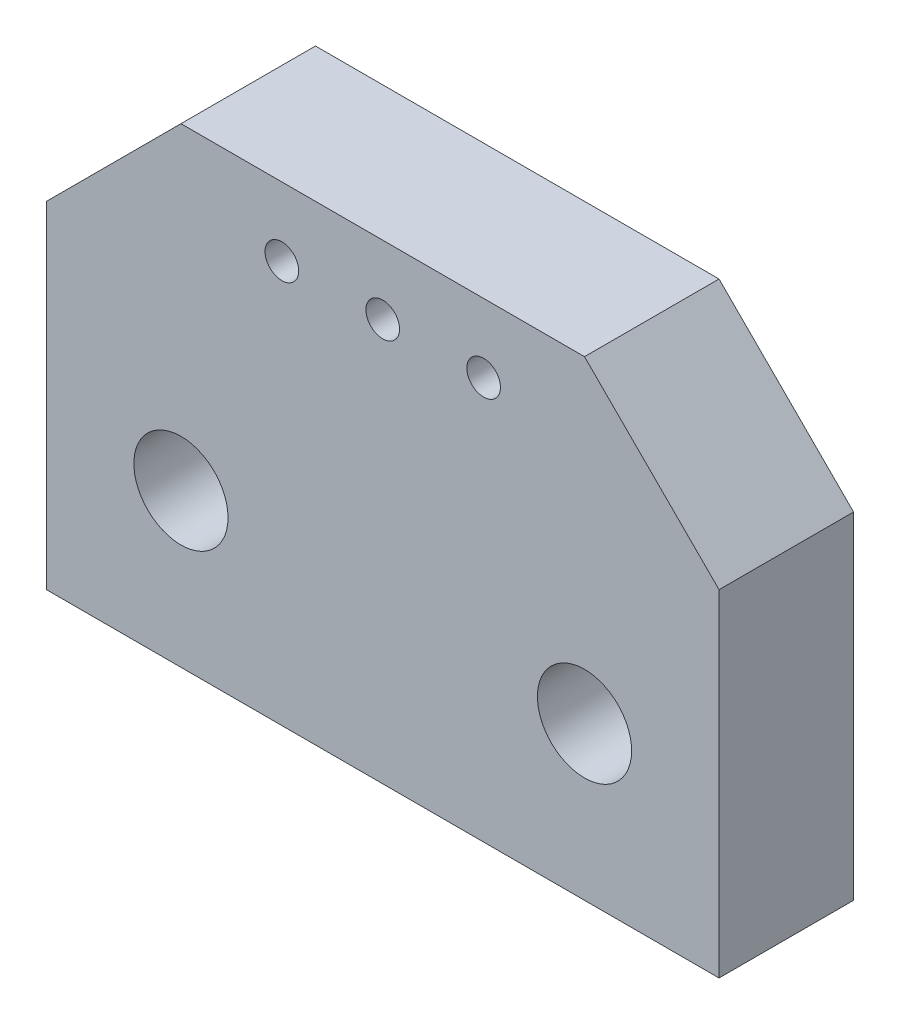
ISO-10303-21;
HEADER;
FILE_DESCRIPTION(('STEP AP214'),'2;1');
FILE_NAME('part.step','',(''),(''),'','','');
FILE_SCHEMA(('AUTOMOTIVE_DESIGN { 1 0 10303 214 1 1 1 1 }'));
ENDSEC;
DATA;
#1=APPLICATION_CONTEXT('core data for automotive mechanical design processes');
#2=APPLICATION_PROTOCOL_DEFINITION('international standard','automotive_design',2000,#1);
#3=PRODUCT_CONTEXT('',#1,'mechanical');
#4=PRODUCT('Part','Part','',(#3));
#5=PRODUCT_RELATED_PRODUCT_CATEGORY('part','',(#4));
#6=PRODUCT_DEFINITION_FORMATION('','',#4);
#7=PRODUCT_DEFINITION_CONTEXT('part definition',#1,'design');
#8=PRODUCT_DEFINITION('design','',#6,#7);
#9=PRODUCT_DEFINITION_SHAPE('','',#8);
#10=(LENGTH_UNIT() NAMED_UNIT(*) SI_UNIT(.MILLI.,.METRE.));
#11=(NAMED_UNIT(*) PLANE_ANGLE_UNIT() SI_UNIT($,.RADIAN.));
#12=(NAMED_UNIT(*) SI_UNIT($,.STERADIAN.) SOLID_ANGLE_UNIT());
#13=UNCERTAINTY_MEASURE_WITH_UNIT(LENGTH_MEASURE(1.E-05),#10,'distance_accuracy_value','');
#14=(GEOMETRIC_REPRESENTATION_CONTEXT(3) GLOBAL_UNCERTAINTY_ASSIGNED_CONTEXT((#13)) GLOBAL_UNIT_ASSIGNED_CONTEXT((#10,
#11,#12)) REPRESENTATION_CONTEXT('',''));
#15=CARTESIAN_POINT('',(0.,0.,0.));
#16=DIRECTION('',(0.,0.,1.));
#17=DIRECTION('',(1.,0.,0.));
#18=AXIS2_PLACEMENT_3D('',#15,#16,#17);
#19=CARTESIAN_POINT('',(0.,0.,2.));
#20=DIRECTION('',(0.,0.,-1.));
#21=DIRECTION('',(-1.,0.,0.));
#22=AXIS2_PLACEMENT_3D('',#19,#20,#21);
#23=PLANE('',#22);
#24=CARTESIAN_POINT('',(6.09710991907803,5.97930011210051,2.));
#25=DIRECTION('',(0.,0.,1.));
#26=DIRECTION('',(1.,0.,0.));
#27=AXIS2_PLACEMENT_3D('',#24,#25,#26);
#28=CIRCLE('',#27,0.249999999999999);
#29=CARTESIAN_POINT('',(6.34710991907803,5.97930011210051,2.));
#30=VERTEX_POINT('',#29);
#31=EDGE_CURVE('E189',#30,#30,#28,.T.);
#32=ORIENTED_EDGE('',*,*,#31,.F.);
#33=EDGE_LOOP('',(#32));
#34=FACE_BOUND('',#33,.T.);
#35=CARTESIAN_POINT('',(4.59710991907803,5.97930011210051,2.));
#36=DIRECTION('',(0.,0.,1.));
#37=DIRECTION('',(1.,0.,0.));
#38=AXIS2_PLACEMENT_3D('',#35,#36,#37);
#39=CIRCLE('',#38,0.249999999999999);
#40=CARTESIAN_POINT('',(4.84710991907803,5.97930011210051,2.));
#41=VERTEX_POINT('',#40);
#42=EDGE_CURVE('E191',#41,#41,#39,.T.);
#43=ORIENTED_EDGE('',*,*,#42,.F.);
#44=EDGE_LOOP('',(#43));
#45=FACE_BOUND('',#44,.T.);
#46=DIRECTION('',(1.,0.,0.));
#47=VECTOR('',#46,1.);
#48=CARTESIAN_POINT('',(11.097109919078,0.,2.));
#49=LINE('',#48,#47);
#50=CARTESIAN_POINT('',(1.09710991907802,0.,2.));
#51=VERTEX_POINT('',#50);
#52=CARTESIAN_POINT('',(11.097109919078,0.,2.));
#53=VERTEX_POINT('',#52);
#54=EDGE_CURVE('E130',#51,#53,#49,.T.);
#55=ORIENTED_EDGE('',*,*,#54,.T.);
#56=DIRECTION('',(0.,1.,0.));
#57=VECTOR('',#56,1.);
#58=CARTESIAN_POINT('',(11.097109919078,5.,2.));
#59=LINE('',#58,#57);
#60=CARTESIAN_POINT('',(11.097109919078,5.,2.));
#61=VERTEX_POINT('',#60);
#62=EDGE_CURVE('E88',#53,#61,#59,.T.);
#63=ORIENTED_EDGE('',*,*,#62,.T.);
#64=DIRECTION('',(-0.707106781186547,0.707106781186547,0.));
#65=VECTOR('',#64,1.);
#66=CARTESIAN_POINT('',(9.09710991907796,7.00000000000008,2.));
#67=LINE('',#66,#65);
#68=CARTESIAN_POINT('',(9.09710991907796,7.00000000000008,2.));
#69=VERTEX_POINT('',#68);
#70=EDGE_CURVE('E101',#61,#69,#67,.T.);
#71=ORIENTED_EDGE('',*,*,#70,.T.);
#72=DIRECTION('',(-1.,0.,0.));
#73=VECTOR('',#72,1.);
#74=CARTESIAN_POINT('',(3.09710991907811,7.00000000000008,2.));
#75=LINE('',#74,#73);
#76=CARTESIAN_POINT('',(3.09710991907811,7.00000000000008,2.));
#77=VERTEX_POINT('',#76);
#78=EDGE_CURVE('E95',#69,#77,#75,.T.);
#79=ORIENTED_EDGE('',*,*,#78,.T.);
#80=DIRECTION('',(-0.707106781186547,-0.707106781186547,0.));
#81=VECTOR('',#80,1.);
#82=CARTESIAN_POINT('',(1.09710991907803,5.,2.));
#83=LINE('',#82,#81);
#84=CARTESIAN_POINT('',(1.09710991907803,5.,2.));
#85=VERTEX_POINT('',#84);
#86=EDGE_CURVE('E99',#77,#85,#83,.T.);
#87=ORIENTED_EDGE('',*,*,#86,.T.);
#88=DIRECTION('',(0.,-1.,0.));
#89=VECTOR('',#88,1.);
#90=CARTESIAN_POINT('',(1.09710991907802,0.,2.));
#91=LINE('',#90,#89);
#92=EDGE_CURVE('E51',#85,#51,#91,.T.);
#93=ORIENTED_EDGE('',*,*,#92,.T.);
#94=EDGE_LOOP('',(#55,#63,#71,#79,#87,#93));
#95=FACE_BOUND('',#94,.T.);
#96=CARTESIAN_POINT('',(9.09710991907803,2.27502281048797,2.));
#97=DIRECTION('',(0.,0.,1.));
#98=DIRECTION('',(1.,0.,0.));
#99=AXIS2_PLACEMENT_3D('',#96,#97,#98);
#100=CIRCLE('',#99,0.699999999999989);
#101=CARTESIAN_POINT('',(9.79710991907802,2.27502281048797,2.));
#102=VERTEX_POINT('',#101);
#103=EDGE_CURVE('E210',#102,#102,#100,.T.);
#104=ORIENTED_EDGE('',*,*,#103,.F.);
#105=EDGE_LOOP('',(#104));
#106=FACE_BOUND('',#105,.T.);
#107=CARTESIAN_POINT('',(3.09710991907803,2.27502281048797,2.));
#108=DIRECTION('',(0.,0.,1.));
#109=DIRECTION('',(1.,0.,0.));
#110=AXIS2_PLACEMENT_3D('',#107,#108,#109);
#111=CIRCLE('',#110,0.699999999999989);
#112=CARTESIAN_POINT('',(3.79710991907802,2.27502281048797,2.));
#113=VERTEX_POINT('',#112);
#114=EDGE_CURVE('E204',#113,#113,#111,.T.);
#115=ORIENTED_EDGE('',*,*,#114,.F.);
#116=EDGE_LOOP('',(#115));
#117=FACE_BOUND('',#116,.T.);
#118=CARTESIAN_POINT('',(7.59710991907803,5.97930011210051,2.));
#119=DIRECTION('',(0.,0.,1.));
#120=DIRECTION('',(1.,0.,0.));
#121=AXIS2_PLACEMENT_3D('',#118,#119,#120);
#122=CIRCLE('',#121,0.249999999999999);
#123=CARTESIAN_POINT('',(7.84710991907803,5.97930011210051,2.));
#124=VERTEX_POINT('',#123);
#125=EDGE_CURVE('E198',#124,#124,#122,.T.);
#126=ORIENTED_EDGE('',*,*,#125,.F.);
#127=EDGE_LOOP('',(#126));
#128=FACE_BOUND('',#127,.T.);
#129=ADVANCED_FACE('F33',(#34,#45,#95,#106,#117,#128),#23,.F.);
#130=CARTESIAN_POINT('',(11.097109919078,0.,2.));
#131=DIRECTION('',(0.,1.,0.));
#132=DIRECTION('',(-1.,0.,0.));
#133=AXIS2_PLACEMENT_3D('',#130,#131,#132);
#134=PLANE('',#133);
#135=DIRECTION('',(1.,0.,0.));
#136=VECTOR('',#135,1.);
#137=CARTESIAN_POINT('',(11.097109919078,0.,0.));
#138=LINE('',#137,#136);
#139=CARTESIAN_POINT('',(1.09710991907802,0.,0.));
#140=VERTEX_POINT('',#139);
#141=CARTESIAN_POINT('',(11.097109919078,0.,0.));
#142=VERTEX_POINT('',#141);
#143=EDGE_CURVE('E119',#140,#142,#138,.T.);
#144=ORIENTED_EDGE('',*,*,#143,.T.);
#145=DIRECTION('',(0.,0.,-1.));
#146=VECTOR('',#145,1.);
#147=CARTESIAN_POINT('',(11.097109919078,0.,2.));
#148=LINE('',#147,#146);
#149=EDGE_CURVE('E11',#53,#142,#148,.T.);
#150=ORIENTED_EDGE('',*,*,#149,.F.);
#151=ORIENTED_EDGE('',*,*,#54,.F.);
#152=DIRECTION('',(0.,0.,-1.));
#153=VECTOR('',#152,1.);
#154=CARTESIAN_POINT('',(1.09710991907802,0.,2.));
#155=LINE('',#154,#153);
#156=EDGE_CURVE('E115',#51,#140,#155,.T.);
#157=ORIENTED_EDGE('',*,*,#156,.T.);
#158=EDGE_LOOP('',(#144,#150,#151,#157));
#159=FACE_BOUND('',#158,.T.);
#160=ADVANCED_FACE('F35',(#159),#134,.F.);
#161=CARTESIAN_POINT('',(11.097109919078,5.,2.));
#162=DIRECTION('',(-1.,0.,0.));
#163=DIRECTION('',(0.,-1.,0.));
#164=AXIS2_PLACEMENT_3D('',#161,#162,#163);
#165=PLANE('',#164);
#166=DIRECTION('',(0.,1.,0.));
#167=VECTOR('',#166,1.);
#168=CARTESIAN_POINT('',(11.097109919078,5.,0.));
#169=LINE('',#168,#167);
#170=CARTESIAN_POINT('',(11.097109919078,5.,0.));
#171=VERTEX_POINT('',#170);
#172=EDGE_CURVE('E122',#142,#171,#169,.T.);
#173=ORIENTED_EDGE('',*,*,#172,.T.);
#174=DIRECTION('',(0.,0.,-1.));
#175=VECTOR('',#174,1.);
#176=CARTESIAN_POINT('',(11.097109919078,5.,2.));
#177=LINE('',#176,#175);
#178=EDGE_CURVE('E43',#61,#171,#177,.T.);
#179=ORIENTED_EDGE('',*,*,#178,.F.);
#180=ORIENTED_EDGE('',*,*,#62,.F.);
#181=ORIENTED_EDGE('',*,*,#149,.T.);
#182=EDGE_LOOP('',(#173,#179,#180,#181));
#183=FACE_BOUND('',#182,.T.);
#184=ADVANCED_FACE('F161',(#183),#165,.F.);
#185=CARTESIAN_POINT('',(9.09710991907796,7.00000000000008,2.));
#186=DIRECTION('',(-0.707106781186547,-0.707106781186547,0.));
#187=DIRECTION('',(0.707106781186548,-0.707106781186548,0.));
#188=AXIS2_PLACEMENT_3D('',#185,#186,#187);
#189=PLANE('',#188);
#190=DIRECTION('',(-0.707106781186547,0.707106781186547,0.));
#191=VECTOR('',#190,1.);
#192=CARTESIAN_POINT('',(9.09710991907796,7.00000000000008,0.));
#193=LINE('',#192,#191);
#194=CARTESIAN_POINT('',(9.09710991907796,7.00000000000008,0.));
#195=VERTEX_POINT('',#194);
#196=EDGE_CURVE('E125',#171,#195,#193,.T.);
#197=ORIENTED_EDGE('',*,*,#196,.T.);
#198=DIRECTION('',(0.,0.,-1.));
#199=VECTOR('',#198,1.);
#200=CARTESIAN_POINT('',(9.09710991907796,7.00000000000008,2.));
#201=LINE('',#200,#199);
#202=EDGE_CURVE('E110',#69,#195,#201,.T.);
#203=ORIENTED_EDGE('',*,*,#202,.F.);
#204=ORIENTED_EDGE('',*,*,#70,.F.);
#205=ORIENTED_EDGE('',*,*,#178,.T.);
#206=EDGE_LOOP('',(#197,#203,#204,#205));
#207=FACE_BOUND('',#206,.T.);
#208=ADVANCED_FACE('F137',(#207),#189,.F.);
#209=CARTESIAN_POINT('',(3.09710991907811,7.00000000000008,2.));
#210=DIRECTION('',(0.,-1.,0.));
#211=DIRECTION('',(0.,0.,-1.));
#212=AXIS2_PLACEMENT_3D('',#209,#210,#211);
#213=PLANE('',#212);
#214=DIRECTION('',(-1.,0.,0.));
#215=VECTOR('',#214,1.);
#216=CARTESIAN_POINT('',(3.09710991907811,7.00000000000008,0.));
#217=LINE('',#216,#215);
#218=CARTESIAN_POINT('',(3.09710991907811,7.00000000000008,0.));
#219=VERTEX_POINT('',#218);
#220=EDGE_CURVE('E109',#195,#219,#217,.T.);
#221=ORIENTED_EDGE('',*,*,#220,.T.);
#222=DIRECTION('',(0.,0.,-1.));
#223=VECTOR('',#222,1.);
#224=CARTESIAN_POINT('',(3.09710991907811,7.00000000000008,2.));
#225=LINE('',#224,#223);
#226=EDGE_CURVE('E106',#77,#219,#225,.T.);
#227=ORIENTED_EDGE('',*,*,#226,.F.);
#228=ORIENTED_EDGE('',*,*,#78,.F.);
#229=ORIENTED_EDGE('',*,*,#202,.T.);
#230=EDGE_LOOP('',(#221,#227,#228,#229));
#231=FACE_BOUND('',#230,.T.);
#232=ADVANCED_FACE('F107',(#231),#213,.F.);
#233=CARTESIAN_POINT('',(1.09710991907803,5.,2.));
#234=DIRECTION('',(0.707106781186547,-0.707106781186547,0.));
#235=DIRECTION('',(0.707106781186548,0.707106781186548,0.));
#236=AXIS2_PLACEMENT_3D('',#233,#234,#235);
#237=PLANE('',#236);
#238=DIRECTION('',(-0.707106781186547,-0.707106781186547,0.));
#239=VECTOR('',#238,1.);
#240=CARTESIAN_POINT('',(1.09710991907803,5.,0.));
#241=LINE('',#240,#239);
#242=CARTESIAN_POINT('',(1.09710991907803,5.,0.));
#243=VERTEX_POINT('',#242);
#244=EDGE_CURVE('E74',#219,#243,#241,.T.);
#245=ORIENTED_EDGE('',*,*,#244,.T.);
#246=DIRECTION('',(0.,0.,-1.));
#247=VECTOR('',#246,1.);
#248=CARTESIAN_POINT('',(1.09710991907803,5.,2.));
#249=LINE('',#248,#247);
#250=EDGE_CURVE('E111',#85,#243,#249,.T.);
#251=ORIENTED_EDGE('',*,*,#250,.F.);
#252=ORIENTED_EDGE('',*,*,#86,.F.);
#253=ORIENTED_EDGE('',*,*,#226,.T.);
#254=EDGE_LOOP('',(#245,#251,#252,#253));
#255=FACE_BOUND('',#254,.T.);
#256=ADVANCED_FACE('F113',(#255),#237,.F.);
#257=CARTESIAN_POINT('',(1.09710991907802,0.,2.));
#258=DIRECTION('',(1.,0.,0.));
#259=DIRECTION('',(0.,1.,0.));
#260=AXIS2_PLACEMENT_3D('',#257,#258,#259);
#261=PLANE('',#260);
#262=DIRECTION('',(0.,-1.,0.));
#263=VECTOR('',#262,1.);
#264=CARTESIAN_POINT('',(1.09710991907802,0.,0.));
#265=LINE('',#264,#263);
#266=EDGE_CURVE('E80',#243,#140,#265,.T.);
#267=ORIENTED_EDGE('',*,*,#266,.T.);
#268=ORIENTED_EDGE('',*,*,#156,.F.);
#269=ORIENTED_EDGE('',*,*,#92,.F.);
#270=ORIENTED_EDGE('',*,*,#250,.T.);
#271=EDGE_LOOP('',(#267,#268,#269,#270));
#272=FACE_BOUND('',#271,.T.);
#273=ADVANCED_FACE('F144',(#272),#261,.F.);
#274=CARTESIAN_POINT('',(0.,0.,0.));
#275=DIRECTION('',(0.,0.,-1.));
#276=DIRECTION('',(-1.,0.,0.));
#277=AXIS2_PLACEMENT_3D('',#274,#275,#276);
#278=PLANE('',#277);
#279=CARTESIAN_POINT('',(6.09710991907803,5.97930011210051,0.));
#280=DIRECTION('',(0.,0.,-1.));
#281=DIRECTION('',(-1.,0.,0.));
#282=AXIS2_PLACEMENT_3D('',#279,#280,#281);
#283=CIRCLE('',#282,0.249999999999998);
#284=CARTESIAN_POINT('',(5.84710991907804,5.97930011210051,0.));
#285=VERTEX_POINT('',#284);
#286=EDGE_CURVE('E37',#285,#285,#283,.T.);
#287=ORIENTED_EDGE('',*,*,#286,.F.);
#288=EDGE_LOOP('',(#287));
#289=FACE_BOUND('',#288,.T.);
#290=CARTESIAN_POINT('',(4.59710991907803,5.97930011210051,0.));
#291=DIRECTION('',(0.,0.,-1.));
#292=DIRECTION('',(-1.,0.,0.));
#293=AXIS2_PLACEMENT_3D('',#290,#291,#292);
#294=CIRCLE('',#293,0.249999999999998);
#295=CARTESIAN_POINT('',(4.34710991907803,5.97930011210051,0.));
#296=VERTEX_POINT('',#295);
#297=EDGE_CURVE('E195',#296,#296,#294,.T.);
#298=ORIENTED_EDGE('',*,*,#297,.F.);
#299=EDGE_LOOP('',(#298));
#300=FACE_BOUND('',#299,.T.);
#301=CARTESIAN_POINT('',(7.59710991907803,5.97930011210051,0.));
#302=DIRECTION('',(0.,0.,-1.));
#303=DIRECTION('',(-1.,0.,0.));
#304=AXIS2_PLACEMENT_3D('',#301,#302,#303);
#305=CIRCLE('',#304,0.249999999999998);
#306=CARTESIAN_POINT('',(7.34710991907804,5.97930011210051,0.));
#307=VERTEX_POINT('',#306);
#308=EDGE_CURVE('E201',#307,#307,#305,.T.);
#309=ORIENTED_EDGE('',*,*,#308,.F.);
#310=EDGE_LOOP('',(#309));
#311=FACE_BOUND('',#310,.T.);
#312=CARTESIAN_POINT('',(3.09710991907803,2.27502281048797,0.));
#313=DIRECTION('',(0.,0.,-1.));
#314=DIRECTION('',(-1.,0.,0.));
#315=AXIS2_PLACEMENT_3D('',#312,#313,#314);
#316=CIRCLE('',#315,0.699999999999988);
#317=CARTESIAN_POINT('',(2.39710991907805,2.27502281048797,0.));
#318=VERTEX_POINT('',#317);
#319=EDGE_CURVE('E207',#318,#318,#316,.T.);
#320=ORIENTED_EDGE('',*,*,#319,.F.);
#321=EDGE_LOOP('',(#320));
#322=FACE_BOUND('',#321,.T.);
#323=CARTESIAN_POINT('',(9.09710991907803,2.27502281048797,0.));
#324=DIRECTION('',(0.,0.,-1.));
#325=DIRECTION('',(-1.,0.,0.));
#326=AXIS2_PLACEMENT_3D('',#323,#324,#325);
#327=CIRCLE('',#326,0.699999999999988);
#328=CARTESIAN_POINT('',(8.39710991907805,2.27502281048797,0.));
#329=VERTEX_POINT('',#328);
#330=EDGE_CURVE('E123',#329,#329,#327,.T.);
#331=ORIENTED_EDGE('',*,*,#330,.F.);
#332=EDGE_LOOP('',(#331));
#333=FACE_BOUND('',#332,.T.);
#334=ORIENTED_EDGE('',*,*,#143,.F.);
#335=ORIENTED_EDGE('',*,*,#266,.F.);
#336=ORIENTED_EDGE('',*,*,#244,.F.);
#337=ORIENTED_EDGE('',*,*,#220,.F.);
#338=ORIENTED_EDGE('',*,*,#196,.F.);
#339=ORIENTED_EDGE('',*,*,#172,.F.);
#340=EDGE_LOOP('',(#334,#335,#336,#337,#338,#339));
#341=FACE_BOUND('',#340,.T.);
#342=ADVANCED_FACE('F140',(#289,#300,#311,#322,#333,#341),#278,.T.);
#343=CARTESIAN_POINT('',(9.09710991907803,2.27502281048797,2.));
#344=DIRECTION('',(0.,0.,1.));
#345=DIRECTION('',(1.,0.,0.));
#346=AXIS2_PLACEMENT_3D('',#343,#344,#345);
#347=CYLINDRICAL_SURFACE('',#346,0.699999999999988);
#348=ORIENTED_EDGE('',*,*,#330,.T.);
#349=EDGE_LOOP('',(#348));
#350=FACE_BOUND('',#349,.T.);
#351=ORIENTED_EDGE('',*,*,#103,.T.);
#352=EDGE_LOOP('',(#351));
#353=FACE_BOUND('',#352,.T.);
#354=ADVANCED_FACE('F151',(#350,#353),#347,.F.);
#355=CARTESIAN_POINT('',(3.09710991907803,2.27502281048797,2.));
#356=DIRECTION('',(0.,0.,1.));
#357=DIRECTION('',(1.,0.,0.));
#358=AXIS2_PLACEMENT_3D('',#355,#356,#357);
#359=CYLINDRICAL_SURFACE('',#358,0.699999999999988);
#360=ORIENTED_EDGE('',*,*,#319,.T.);
#361=EDGE_LOOP('',(#360));
#362=FACE_BOUND('',#361,.T.);
#363=ORIENTED_EDGE('',*,*,#114,.T.);
#364=EDGE_LOOP('',(#363));
#365=FACE_BOUND('',#364,.T.);
#366=ADVANCED_FACE('F167',(#362,#365),#359,.F.);
#367=CARTESIAN_POINT('',(7.59710991907803,5.97930011210051,2.));
#368=DIRECTION('',(0.,0.,1.));
#369=DIRECTION('',(1.,0.,0.));
#370=AXIS2_PLACEMENT_3D('',#367,#368,#369);
#371=CYLINDRICAL_SURFACE('',#370,0.249999999999998);
#372=ORIENTED_EDGE('',*,*,#308,.T.);
#373=EDGE_LOOP('',(#372));
#374=FACE_BOUND('',#373,.T.);
#375=ORIENTED_EDGE('',*,*,#125,.T.);
#376=EDGE_LOOP('',(#375));
#377=FACE_BOUND('',#376,.T.);
#378=ADVANCED_FACE('F171',(#374,#377),#371,.F.);
#379=CARTESIAN_POINT('',(4.59710991907803,5.97930011210051,2.));
#380=DIRECTION('',(0.,0.,1.));
#381=DIRECTION('',(1.,0.,0.));
#382=AXIS2_PLACEMENT_3D('',#379,#380,#381);
#383=CYLINDRICAL_SURFACE('',#382,0.249999999999998);
#384=ORIENTED_EDGE('',*,*,#297,.T.);
#385=EDGE_LOOP('',(#384));
#386=FACE_BOUND('',#385,.T.);
#387=ORIENTED_EDGE('',*,*,#42,.T.);
#388=EDGE_LOOP('',(#387));
#389=FACE_BOUND('',#388,.T.);
#390=ADVANCED_FACE('F175',(#386,#389),#383,.F.);
#391=CARTESIAN_POINT('',(6.09710991907803,5.97930011210051,2.));
#392=DIRECTION('',(0.,0.,1.));
#393=DIRECTION('',(1.,0.,0.));
#394=AXIS2_PLACEMENT_3D('',#391,#392,#393);
#395=CYLINDRICAL_SURFACE('',#394,0.249999999999998);
#396=ORIENTED_EDGE('',*,*,#286,.T.);
#397=EDGE_LOOP('',(#396));
#398=FACE_BOUND('',#397,.T.);
#399=ORIENTED_EDGE('',*,*,#31,.T.);
#400=EDGE_LOOP('',(#399));
#401=FACE_BOUND('',#400,.T.);
#402=ADVANCED_FACE('F179',(#398,#401),#395,.F.);
#403=CLOSED_SHELL('',(#129,#160,#184,#208,#232,#256,#273,#342,#354,#366,#378,#390,#402));
#404=MANIFOLD_SOLID_BREP('B2',#403);
#405=ADVANCED_BREP_SHAPE_REPRESENTATION('',(#18,#404),#14);
#406=SHAPE_DEFINITION_REPRESENTATION(#9,#405);
ENDSEC;
END-ISO-10303-21;
